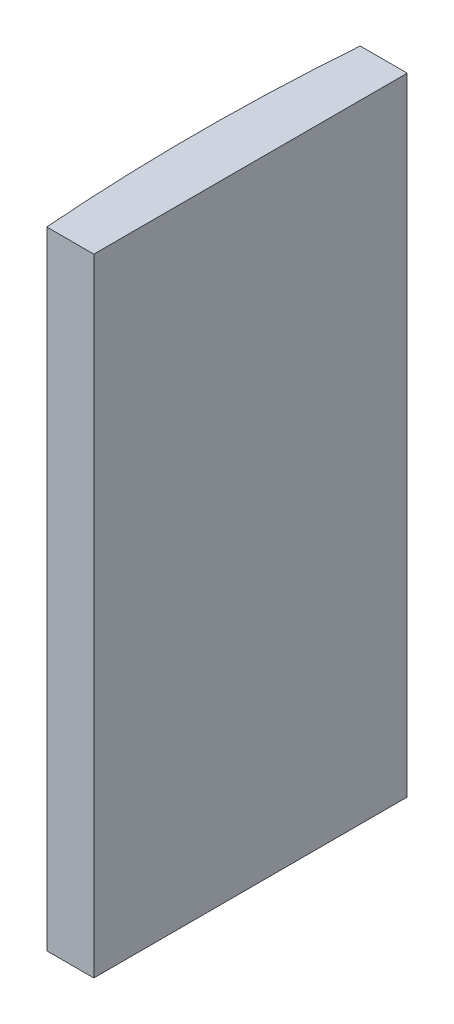
ISO-10303-21;
HEADER;
FILE_DESCRIPTION(('STEP AP214'),'2;1');
FILE_NAME('part.step','',(''),(''),'','','');
FILE_SCHEMA(('AUTOMOTIVE_DESIGN { 1 0 10303 214 1 1 1 1 }'));
ENDSEC;
DATA;
#1=APPLICATION_CONTEXT('core data for automotive mechanical design processes');
#2=APPLICATION_PROTOCOL_DEFINITION('international standard','automotive_design',2000,#1);
#3=PRODUCT_CONTEXT('',#1,'mechanical');
#4=PRODUCT('Part','Part','',(#3));
#5=PRODUCT_RELATED_PRODUCT_CATEGORY('part','',(#4));
#6=PRODUCT_DEFINITION_FORMATION('','',#4);
#7=PRODUCT_DEFINITION_CONTEXT('part definition',#1,'design');
#8=PRODUCT_DEFINITION('design','',#6,#7);
#9=PRODUCT_DEFINITION_SHAPE('','',#8);
#10=(LENGTH_UNIT() NAMED_UNIT(*) SI_UNIT(.MILLI.,.METRE.));
#11=(NAMED_UNIT(*) PLANE_ANGLE_UNIT() SI_UNIT($,.RADIAN.));
#12=(NAMED_UNIT(*) SI_UNIT($,.STERADIAN.) SOLID_ANGLE_UNIT());
#13=UNCERTAINTY_MEASURE_WITH_UNIT(LENGTH_MEASURE(1.E-05),#10,'distance_accuracy_value','');
#14=(GEOMETRIC_REPRESENTATION_CONTEXT(3) GLOBAL_UNCERTAINTY_ASSIGNED_CONTEXT((#13)) GLOBAL_UNIT_ASSIGNED_CONTEXT((#10,
#11,#12)) REPRESENTATION_CONTEXT('',''));
#15=CARTESIAN_POINT('',(0.,0.,0.));
#16=DIRECTION('',(0.,0.,1.));
#17=DIRECTION('',(1.,0.,0.));
#18=AXIS2_PLACEMENT_3D('',#15,#16,#17);
#19=CARTESIAN_POINT('',(4.35520433485127,40.,0.));
#20=DIRECTION('',(0.,-1.,0.));
#21=DIRECTION('',(0.,0.,-1.));
#22=AXIS2_PLACEMENT_3D('',#19,#20,#21);
#23=CYLINDRICAL_SURFACE('',#22,129.25);
#24=CARTESIAN_POINT('',(4.35520433485127,0.,0.));
#25=DIRECTION('',(0.,1.,0.));
#26=DIRECTION('',(0.,0.,1.));
#27=AXIS2_PLACEMENT_3D('',#24,#25,#26);
#28=CIRCLE('',#27,129.25);
#29=CARTESIAN_POINT('',(-124.507367810826,0.,-10.));
#30=VERTEX_POINT('',#29);
#31=CARTESIAN_POINT('',(-124.507367810826,0.,10.));
#32=VERTEX_POINT('',#31);
#33=EDGE_CURVE('E100',#30,#32,#28,.T.);
#34=ORIENTED_EDGE('',*,*,#33,.T.);
#35=DIRECTION('',(0.,-1.,0.));
#36=VECTOR('',#35,1.);
#37=CARTESIAN_POINT('',(-124.507367810826,40.,10.));
#38=LINE('',#37,#36);
#39=CARTESIAN_POINT('',(-124.507367810826,40.,10.));
#40=VERTEX_POINT('',#39);
#41=EDGE_CURVE('E11',#40,#32,#38,.T.);
#42=ORIENTED_EDGE('',*,*,#41,.F.);
#43=CARTESIAN_POINT('',(4.35520433485127,40.,0.));
#44=DIRECTION('',(0.,1.,0.));
#45=DIRECTION('',(0.,0.,1.));
#46=AXIS2_PLACEMENT_3D('',#43,#44,#45);
#47=CIRCLE('',#46,129.25);
#48=CARTESIAN_POINT('',(-124.507367810826,40.,-10.));
#49=VERTEX_POINT('',#48);
#50=EDGE_CURVE('E88',#49,#40,#47,.T.);
#51=ORIENTED_EDGE('',*,*,#50,.F.);
#52=DIRECTION('',(0.,-1.,0.));
#53=VECTOR('',#52,1.);
#54=CARTESIAN_POINT('',(-124.507367810826,40.,-10.));
#55=LINE('',#54,#53);
#56=EDGE_CURVE('E96',#49,#30,#55,.T.);
#57=ORIENTED_EDGE('',*,*,#56,.T.);
#58=EDGE_LOOP('',(#34,#42,#51,#57));
#59=FACE_BOUND('',#58,.T.);
#60=ADVANCED_FACE('F37',(#59),#23,.T.);
#61=CARTESIAN_POINT('',(-124.507367810826,40.,10.));
#62=DIRECTION('',(0.,0.,-1.));
#63=DIRECTION('',(-1.,0.,0.));
#64=AXIS2_PLACEMENT_3D('',#61,#62,#63);
#65=PLANE('',#64);
#66=DIRECTION('',(1.,0.,0.));
#67=VECTOR('',#66,1.);
#68=CARTESIAN_POINT('',(-124.507367810826,0.,10.));
#69=LINE('',#68,#67);
#70=CARTESIAN_POINT('',(-121.504795665149,0.,10.));
#71=VERTEX_POINT('',#70);
#72=EDGE_CURVE('E92',#32,#71,#69,.T.);
#73=ORIENTED_EDGE('',*,*,#72,.T.);
#74=DIRECTION('',(0.,-1.,0.));
#75=VECTOR('',#74,1.);
#76=CARTESIAN_POINT('',(-121.504795665149,40.,10.));
#77=LINE('',#76,#75);
#78=CARTESIAN_POINT('',(-121.504795665149,40.,10.));
#79=VERTEX_POINT('',#78);
#80=EDGE_CURVE('E45',#79,#71,#77,.T.);
#81=ORIENTED_EDGE('',*,*,#80,.F.);
#82=DIRECTION('',(1.,0.,0.));
#83=VECTOR('',#82,1.);
#84=CARTESIAN_POINT('',(-124.507367810826,40.,10.));
#85=LINE('',#84,#83);
#86=EDGE_CURVE('E83',#40,#79,#85,.T.);
#87=ORIENTED_EDGE('',*,*,#86,.F.);
#88=ORIENTED_EDGE('',*,*,#41,.T.);
#89=EDGE_LOOP('',(#73,#81,#87,#88));
#90=FACE_BOUND('',#89,.T.);
#91=ADVANCED_FACE('F91',(#90),#65,.F.);
#92=CARTESIAN_POINT('',(-121.504795665149,40.,-9.99999999999999));
#93=DIRECTION('',(-1.,0.,0.));
#94=DIRECTION('',(0.,0.,1.));
#95=AXIS2_PLACEMENT_3D('',#92,#93,#94);
#96=PLANE('',#95);
#97=DIRECTION('',(0.,0.,-1.));
#98=VECTOR('',#97,1.);
#99=CARTESIAN_POINT('',(-121.504795665149,0.,-9.99999999999999));
#100=LINE('',#99,#98);
#101=CARTESIAN_POINT('',(-121.504795665149,0.,-9.99999999999999));
#102=VERTEX_POINT('',#101);
#103=EDGE_CURVE('E70',#71,#102,#100,.T.);
#104=ORIENTED_EDGE('',*,*,#103,.T.);
#105=DIRECTION('',(0.,-1.,0.));
#106=VECTOR('',#105,1.);
#107=CARTESIAN_POINT('',(-121.504795665149,40.,-9.99999999999999));
#108=LINE('',#107,#106);
#109=CARTESIAN_POINT('',(-121.504795665149,40.,-9.99999999999999));
#110=VERTEX_POINT('',#109);
#111=EDGE_CURVE('E93',#110,#102,#108,.T.);
#112=ORIENTED_EDGE('',*,*,#111,.F.);
#113=DIRECTION('',(0.,0.,-1.));
#114=VECTOR('',#113,1.);
#115=CARTESIAN_POINT('',(-121.504795665149,40.,-9.99999999999999));
#116=LINE('',#115,#114);
#117=EDGE_CURVE('E86',#79,#110,#116,.T.);
#118=ORIENTED_EDGE('',*,*,#117,.F.);
#119=ORIENTED_EDGE('',*,*,#80,.T.);
#120=EDGE_LOOP('',(#104,#112,#118,#119));
#121=FACE_BOUND('',#120,.T.);
#122=ADVANCED_FACE('F94',(#121),#96,.F.);
#123=CARTESIAN_POINT('',(-124.507367810826,40.,-10.));
#124=DIRECTION('',(0.,0.,1.));
#125=DIRECTION('',(1.,0.,0.));
#126=AXIS2_PLACEMENT_3D('',#123,#124,#125);
#127=PLANE('',#126);
#128=DIRECTION('',(-1.,0.,0.));
#129=VECTOR('',#128,1.);
#130=CARTESIAN_POINT('',(-124.507367810826,0.,-10.));
#131=LINE('',#130,#129);
#132=EDGE_CURVE('E76',#102,#30,#131,.T.);
#133=ORIENTED_EDGE('',*,*,#132,.T.);
#134=ORIENTED_EDGE('',*,*,#56,.F.);
#135=DIRECTION('',(-1.,0.,0.));
#136=VECTOR('',#135,1.);
#137=CARTESIAN_POINT('',(-124.507367810826,40.,-10.));
#138=LINE('',#137,#136);
#139=EDGE_CURVE('E53',#110,#49,#138,.T.);
#140=ORIENTED_EDGE('',*,*,#139,.F.);
#141=ORIENTED_EDGE('',*,*,#111,.T.);
#142=EDGE_LOOP('',(#133,#134,#140,#141));
#143=FACE_BOUND('',#142,.T.);
#144=ADVANCED_FACE('F107',(#143),#127,.F.);
#145=CARTESIAN_POINT('',(4.35520433485127,40.,0.));
#146=DIRECTION('',(0.,1.,0.));
#147=DIRECTION('',(0.,0.,1.));
#148=AXIS2_PLACEMENT_3D('',#145,#146,#147);
#149=PLANE('',#148);
#150=ORIENTED_EDGE('',*,*,#50,.T.);
#151=ORIENTED_EDGE('',*,*,#86,.T.);
#152=ORIENTED_EDGE('',*,*,#117,.T.);
#153=ORIENTED_EDGE('',*,*,#139,.T.);
#154=EDGE_LOOP('',(#150,#151,#152,#153));
#155=FACE_BOUND('',#154,.T.);
#156=ADVANCED_FACE('F84',(#155),#149,.T.);
#157=CARTESIAN_POINT('',(4.35520433485127,0.,0.));
#158=DIRECTION('',(0.,1.,0.));
#159=DIRECTION('',(0.,0.,1.));
#160=AXIS2_PLACEMENT_3D('',#157,#158,#159);
#161=PLANE('',#160);
#162=ORIENTED_EDGE('',*,*,#33,.F.);
#163=ORIENTED_EDGE('',*,*,#132,.F.);
#164=ORIENTED_EDGE('',*,*,#103,.F.);
#165=ORIENTED_EDGE('',*,*,#72,.F.);
#166=EDGE_LOOP('',(#162,#163,#164,#165));
#167=FACE_BOUND('',#166,.T.);
#168=ADVANCED_FACE('F110',(#167),#161,.F.);
#169=CLOSED_SHELL('',(#60,#91,#122,#144,#156,#168));
#170=MANIFOLD_SOLID_BREP('B2',#169);
#171=ADVANCED_BREP_SHAPE_REPRESENTATION('',(#18,#170),#14);
#172=SHAPE_DEFINITION_REPRESENTATION(#9,#171);
ENDSEC;
END-ISO-10303-21;
